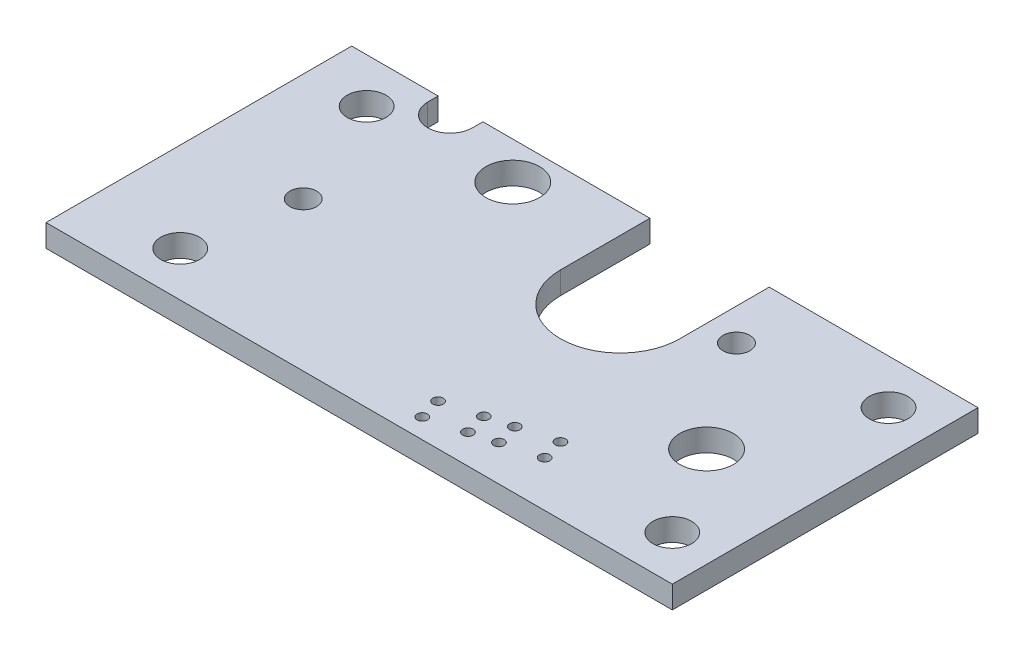
ISO-10303-21;
HEADER;
FILE_DESCRIPTION(('STEP AP214'),'2;1');
FILE_NAME('part.step','',(''),(''),'','','');
FILE_SCHEMA(('AUTOMOTIVE_DESIGN { 1 0 10303 214 1 1 1 1 }'));
ENDSEC;
DATA;
#1=APPLICATION_CONTEXT('core data for automotive mechanical design processes');
#2=APPLICATION_PROTOCOL_DEFINITION('international standard','automotive_design',2000,#1);
#3=PRODUCT_CONTEXT('',#1,'mechanical');
#4=PRODUCT('Part','Part','',(#3));
#5=PRODUCT_RELATED_PRODUCT_CATEGORY('part','',(#4));
#6=PRODUCT_DEFINITION_FORMATION('','',#4);
#7=PRODUCT_DEFINITION_CONTEXT('part definition',#1,'design');
#8=PRODUCT_DEFINITION('design','',#6,#7);
#9=PRODUCT_DEFINITION_SHAPE('','',#8);
#10=(LENGTH_UNIT() NAMED_UNIT(*) SI_UNIT(.MILLI.,.METRE.));
#11=(NAMED_UNIT(*) PLANE_ANGLE_UNIT() SI_UNIT($,.RADIAN.));
#12=(NAMED_UNIT(*) SI_UNIT($,.STERADIAN.) SOLID_ANGLE_UNIT());
#13=UNCERTAINTY_MEASURE_WITH_UNIT(LENGTH_MEASURE(1.E-05),#10,'distance_accuracy_value','');
#14=(GEOMETRIC_REPRESENTATION_CONTEXT(3) GLOBAL_UNCERTAINTY_ASSIGNED_CONTEXT((#13)) GLOBAL_UNIT_ASSIGNED_CONTEXT((#10,
#11,#12)) REPRESENTATION_CONTEXT('',''));
#15=CARTESIAN_POINT('',(0.,0.,0.));
#16=DIRECTION('',(0.,0.,1.));
#17=DIRECTION('',(1.,0.,0.));
#18=AXIS2_PLACEMENT_3D('',#15,#16,#17);
#19=CARTESIAN_POINT('',(0.,1.5,-20.5));
#20=DIRECTION('',(0.,0.,1.));
#21=DIRECTION('',(1.,0.,0.));
#22=AXIS2_PLACEMENT_3D('',#19,#20,#21);
#23=PLANE('',#22);
#24=DIRECTION('',(0.,1.,0.));
#25=VECTOR('',#24,1.);
#26=CARTESIAN_POINT('',(5.79999999999999,-0.000999999999999916,-20.5));
#27=LINE('',#26,#25);
#28=CARTESIAN_POINT('',(5.79999999999999,0.,-20.5));
#29=VERTEX_POINT('',#28);
#30=CARTESIAN_POINT('',(5.79999999999999,1.5,-20.5));
#31=VERTEX_POINT('',#30);
#32=EDGE_CURVE('E131',#29,#31,#27,.T.);
#33=ORIENTED_EDGE('',*,*,#32,.F.);
#34=DIRECTION('',(-1.,0.,0.));
#35=VECTOR('',#34,1.);
#36=CARTESIAN_POINT('',(0.,0.,-20.5));
#37=LINE('',#36,#35);
#38=CARTESIAN_POINT('',(0.,0.,-20.5));
#39=VERTEX_POINT('',#38);
#40=EDGE_CURVE('E148',#29,#39,#37,.T.);
#41=ORIENTED_EDGE('',*,*,#40,.T.);
#42=DIRECTION('',(0.,-1.,0.));
#43=VECTOR('',#42,1.);
#44=CARTESIAN_POINT('',(0.,1.5,-20.5));
#45=LINE('',#44,#43);
#46=CARTESIAN_POINT('',(0.,1.5,-20.5));
#47=VERTEX_POINT('',#46);
#48=EDGE_CURVE('E156',#47,#39,#45,.T.);
#49=ORIENTED_EDGE('',*,*,#48,.F.);
#50=DIRECTION('',(-1.,0.,0.));
#51=VECTOR('',#50,1.);
#52=CARTESIAN_POINT('',(0.,1.5,-20.5));
#53=LINE('',#52,#51);
#54=EDGE_CURVE('E182',#31,#47,#53,.T.);
#55=ORIENTED_EDGE('',*,*,#54,.F.);
#56=EDGE_LOOP('',(#33,#41,#49,#55));
#57=FACE_BOUND('',#56,.T.);
#58=ADVANCED_FACE('F31',(#57),#23,.F.);
#59=CARTESIAN_POINT('',(0.,1.5,-20.5));
#60=DIRECTION('',(0.,-1.,0.));
#61=DIRECTION('',(0.,0.,-1.));
#62=AXIS2_PLACEMENT_3D('',#59,#60,#61);
#63=PLANE('',#62);
#64=CARTESIAN_POINT('',(23.9062614807902,1.5,-1.3268753482699));
#65=DIRECTION('',(0.,1.,0.));
#66=DIRECTION('',(0.,0.,1.));
#67=AXIS2_PLACEMENT_3D('',#64,#65,#66);
#68=CIRCLE('',#67,0.350000000000001);
#69=CARTESIAN_POINT('',(23.9062614807902,1.5,-0.976875348269901));
#70=VERTEX_POINT('',#69);
#71=EDGE_CURVE('E310',#70,#70,#68,.T.);
#72=ORIENTED_EDGE('',*,*,#71,.F.);
#73=EDGE_LOOP('',(#72));
#74=FACE_BOUND('',#73,.T.);
#75=CARTESIAN_POINT('',(26.3210760465129,1.5,-1.97392296102617));
#76=DIRECTION('',(0.,1.,0.));
#77=DIRECTION('',(0.,0.,1.));
#78=AXIS2_PLACEMENT_3D('',#75,#76,#77);
#79=CIRCLE('',#78,0.350000000000001);
#80=CARTESIAN_POINT('',(26.3210760465129,1.5,-1.62392296102617));
#81=VERTEX_POINT('',#80);
#82=EDGE_CURVE('E304',#81,#81,#79,.T.);
#83=ORIENTED_EDGE('',*,*,#82,.F.);
#84=EDGE_LOOP('',(#83));
#85=FACE_BOUND('',#84,.T.);
#86=CARTESIAN_POINT('',(27.9631499512043,1.5,-2.41391533770044));
#87=DIRECTION('',(0.,1.,0.));
#88=DIRECTION('',(0.,0.,1.));
#89=AXIS2_PLACEMENT_3D('',#86,#87,#88);
#90=CIRCLE('',#89,0.350000000000001);
#91=CARTESIAN_POINT('',(27.9631499512043,1.5,-2.06391533770044));
#92=VERTEX_POINT('',#91);
#93=EDGE_CURVE('E298',#92,#92,#90,.T.);
#94=ORIENTED_EDGE('',*,*,#93,.F.);
#95=EDGE_LOOP('',(#94));
#96=FACE_BOUND('',#95,.T.);
#97=CARTESIAN_POINT('',(30.377964516927,1.5,-3.06096295045671));
#98=DIRECTION('',(0.,1.,0.));
#99=DIRECTION('',(0.,0.,1.));
#100=AXIS2_PLACEMENT_3D('',#97,#98,#99);
#101=CIRCLE('',#100,0.350000000000001);
#102=CARTESIAN_POINT('',(30.377964516927,1.5,-2.71096295045671));
#103=VERTEX_POINT('',#102);
#104=EDGE_CURVE('E292',#103,#103,#101,.T.);
#105=ORIENTED_EDGE('',*,*,#104,.F.);
#106=EDGE_LOOP('',(#105));
#107=FACE_BOUND('',#106,.T.);
#108=CARTESIAN_POINT('',(23.5180329131364,1.5,-2.77576408770351));
#109=DIRECTION('',(0.,1.,0.));
#110=DIRECTION('',(0.,0.,1.));
#111=AXIS2_PLACEMENT_3D('',#108,#109,#110);
#112=CIRCLE('',#111,0.350000000000001);
#113=CARTESIAN_POINT('',(23.5180329131364,1.5,-2.42576408770351));
#114=VERTEX_POINT('',#113);
#115=EDGE_CURVE('E286',#114,#114,#112,.T.);
#116=ORIENTED_EDGE('',*,*,#115,.F.);
#117=EDGE_LOOP('',(#116));
#118=FACE_BOUND('',#117,.T.);
#119=CARTESIAN_POINT('',(25.9328474788591,1.5,-3.42281170045978));
#120=DIRECTION('',(0.,1.,0.));
#121=DIRECTION('',(0.,0.,1.));
#122=AXIS2_PLACEMENT_3D('',#119,#120,#121);
#123=CIRCLE('',#122,0.350000000000001);
#124=CARTESIAN_POINT('',(25.9328474788591,1.5,-3.07281170045978));
#125=VERTEX_POINT('',#124);
#126=EDGE_CURVE('E280',#125,#125,#123,.T.);
#127=ORIENTED_EDGE('',*,*,#126,.F.);
#128=EDGE_LOOP('',(#127));
#129=FACE_BOUND('',#128,.T.);
#130=CARTESIAN_POINT('',(27.5749213835505,1.5,-3.86280407713404));
#131=DIRECTION('',(0.,1.,0.));
#132=DIRECTION('',(0.,0.,1.));
#133=AXIS2_PLACEMENT_3D('',#130,#131,#132);
#134=CIRCLE('',#133,0.350000000000001);
#135=CARTESIAN_POINT('',(27.5749213835505,1.5,-3.51280407713404));
#136=VERTEX_POINT('',#135);
#137=EDGE_CURVE('E274',#136,#136,#134,.T.);
#138=ORIENTED_EDGE('',*,*,#137,.F.);
#139=EDGE_LOOP('',(#138));
#140=FACE_BOUND('',#139,.T.);
#141=CARTESIAN_POINT('',(29.9897359492732,1.5,-4.50985168989031));
#142=DIRECTION('',(0.,1.,0.));
#143=DIRECTION('',(0.,0.,1.));
#144=AXIS2_PLACEMENT_3D('',#141,#142,#143);
#145=CIRCLE('',#144,0.350000000000001);
#146=CARTESIAN_POINT('',(29.9897359492732,1.5,-4.15985168989031));
#147=VERTEX_POINT('',#146);
#148=EDGE_CURVE('E268',#147,#147,#145,.T.);
#149=ORIENTED_EDGE('',*,*,#148,.F.);
#150=EDGE_LOOP('',(#149));
#151=FACE_BOUND('',#150,.T.);
#152=CARTESIAN_POINT('',(30.15,1.5,-16.15));
#153=DIRECTION('',(0.,1.,0.));
#154=DIRECTION('',(0.,0.,1.));
#155=AXIS2_PLACEMENT_3D('',#152,#153,#154);
#156=CIRCLE('',#155,0.900000000000001);
#157=CARTESIAN_POINT('',(30.15,1.5,-15.25));
#158=VERTEX_POINT('',#157);
#159=EDGE_CURVE('E259',#158,#158,#156,.T.);
#160=ORIENTED_EDGE('',*,*,#159,.F.);
#161=EDGE_LOOP('',(#160));
#162=FACE_BOUND('',#161,.T.);
#163=CARTESIAN_POINT('',(7.25,1.5,-10.));
#164=DIRECTION('',(0.,1.,0.));
#165=DIRECTION('',(0.,0.,1.));
#166=AXIS2_PLACEMENT_3D('',#163,#164,#165);
#167=CIRCLE('',#166,0.9);
#168=CARTESIAN_POINT('',(7.25,1.5,-9.1));
#169=VERTEX_POINT('',#168);
#170=EDGE_CURVE('E253',#169,#169,#167,.T.);
#171=ORIENTED_EDGE('',*,*,#170,.F.);
#172=EDGE_LOOP('',(#171));
#173=FACE_BOUND('',#172,.T.);
#174=CARTESIAN_POINT('',(39.,1.5,-17.5));
#175=DIRECTION('',(0.,1.,0.));
#176=DIRECTION('',(0.,0.,1.));
#177=AXIS2_PLACEMENT_3D('',#174,#175,#176);
#178=CIRCLE('',#177,1.3);
#179=CARTESIAN_POINT('',(39.,1.5,-16.2));
#180=VERTEX_POINT('',#179);
#181=EDGE_CURVE('E247',#180,#180,#178,.T.);
#182=ORIENTED_EDGE('',*,*,#181,.F.);
#183=EDGE_LOOP('',(#182));
#184=FACE_BOUND('',#183,.T.);
#185=CARTESIAN_POINT('',(39.,1.5,-3.));
#186=DIRECTION('',(0.,1.,0.));
#187=DIRECTION('',(0.,0.,1.));
#188=AXIS2_PLACEMENT_3D('',#185,#186,#187);
#189=CIRCLE('',#188,1.3);
#190=CARTESIAN_POINT('',(39.,1.5,-1.7));
#191=VERTEX_POINT('',#190);
#192=EDGE_CURVE('E241',#191,#191,#189,.T.);
#193=ORIENTED_EDGE('',*,*,#192,.F.);
#194=EDGE_LOOP('',(#193));
#195=FACE_BOUND('',#194,.T.);
#196=CARTESIAN_POINT('',(35.3,1.5,-9.));
#197=DIRECTION('',(0.,1.,0.));
#198=DIRECTION('',(0.,0.,1.));
#199=AXIS2_PLACEMENT_3D('',#196,#197,#198);
#200=CIRCLE('',#199,1.8);
#201=CARTESIAN_POINT('',(35.3,1.5,-7.2));
#202=VERTEX_POINT('',#201);
#203=EDGE_CURVE('E235',#202,#202,#200,.T.);
#204=ORIENTED_EDGE('',*,*,#203,.F.);
#205=EDGE_LOOP('',(#204));
#206=FACE_BOUND('',#205,.T.);
#207=CARTESIAN_POINT('',(13.3,1.5,-18.));
#208=DIRECTION('',(0.,1.,0.));
#209=DIRECTION('',(0.,0.,1.));
#210=AXIS2_PLACEMENT_3D('',#207,#208,#209);
#211=CIRCLE('',#210,1.8);
#212=CARTESIAN_POINT('',(13.3,1.5,-16.2));
#213=VERTEX_POINT('',#212);
#214=EDGE_CURVE('E142',#213,#213,#211,.T.);
#215=ORIENTED_EDGE('',*,*,#214,.F.);
#216=EDGE_LOOP('',(#215));
#217=FACE_BOUND('',#216,.T.);
#218=CARTESIAN_POINT('',(6.,1.5,-3.));
#219=DIRECTION('',(0.,1.,0.));
#220=DIRECTION('',(0.,0.,1.));
#221=AXIS2_PLACEMENT_3D('',#218,#219,#220);
#222=CIRCLE('',#221,1.3);
#223=CARTESIAN_POINT('',(6.,1.5,-1.7));
#224=VERTEX_POINT('',#223);
#225=EDGE_CURVE('E203',#224,#224,#222,.T.);
#226=ORIENTED_EDGE('',*,*,#225,.F.);
#227=EDGE_LOOP('',(#226));
#228=FACE_BOUND('',#227,.T.);
#229=CARTESIAN_POINT('',(4.,1.5,-17.5));
#230=DIRECTION('',(0.,1.,0.));
#231=DIRECTION('',(0.,0.,1.));
#232=AXIS2_PLACEMENT_3D('',#229,#230,#231);
#233=CIRCLE('',#232,1.3);
#234=CARTESIAN_POINT('',(4.,1.5,-16.2));
#235=VERTEX_POINT('',#234);
#236=EDGE_CURVE('E212',#235,#235,#233,.T.);
#237=ORIENTED_EDGE('',*,*,#236,.F.);
#238=EDGE_LOOP('',(#237));
#239=FACE_BOUND('',#238,.T.);
#240=DIRECTION('',(0.,0.,-1.));
#241=VECTOR('',#240,1.);
#242=CARTESIAN_POINT('',(5.79999999999995,1.5,-10.2499999999999));
#243=LINE('',#242,#241);
#244=CARTESIAN_POINT('',(5.79999999999998,1.5,-19.8));
#245=VERTEX_POINT('',#244);
#246=EDGE_CURVE('E228',#245,#31,#243,.T.);
#247=ORIENTED_EDGE('',*,*,#246,.T.);
#248=ORIENTED_EDGE('',*,*,#54,.T.);
#249=DIRECTION('',(0.,0.,1.));
#250=VECTOR('',#249,1.);
#251=CARTESIAN_POINT('',(0.,1.5,0.));
#252=LINE('',#251,#250);
#253=CARTESIAN_POINT('',(0.,1.5,0.));
#254=VERTEX_POINT('',#253);
#255=EDGE_CURVE('E151',#47,#254,#252,.T.);
#256=ORIENTED_EDGE('',*,*,#255,.T.);
#257=DIRECTION('',(1.,0.,0.));
#258=VECTOR('',#257,1.);
#259=CARTESIAN_POINT('',(0.,1.5,0.));
#260=LINE('',#259,#258);
#261=CARTESIAN_POINT('',(42.,1.5,0.));
#262=VERTEX_POINT('',#261);
#263=EDGE_CURVE('E184',#254,#262,#260,.T.);
#264=ORIENTED_EDGE('',*,*,#263,.T.);
#265=DIRECTION('',(0.,0.,-1.));
#266=VECTOR('',#265,1.);
#267=CARTESIAN_POINT('',(42.,1.5,0.));
#268=LINE('',#267,#266);
#269=CARTESIAN_POINT('',(42.,1.5,-20.5));
#270=VERTEX_POINT('',#269);
#271=EDGE_CURVE('E169',#262,#270,#268,.T.);
#272=ORIENTED_EDGE('',*,*,#271,.T.);
#273=CARTESIAN_POINT('',(28.,1.5,-20.5));
#274=VERTEX_POINT('',#273);
#275=EDGE_CURVE('E160',#270,#274,#53,.T.);
#276=ORIENTED_EDGE('',*,*,#275,.T.);
#277=DIRECTION('',(0.,0.,-1.));
#278=VECTOR('',#277,1.);
#279=CARTESIAN_POINT('',(28.,1.5,-10.25));
#280=LINE('',#279,#278);
#281=CARTESIAN_POINT('',(28.,1.5,-14.5));
#282=VERTEX_POINT('',#281);
#283=EDGE_CURVE('E198',#282,#274,#280,.T.);
#284=ORIENTED_EDGE('',*,*,#283,.F.);
#285=CARTESIAN_POINT('',(24.,1.5,-14.5));
#286=DIRECTION('',(0.,1.,0.));
#287=DIRECTION('',(0.,0.,1.));
#288=AXIS2_PLACEMENT_3D('',#285,#286,#287);
#289=CIRCLE('',#288,4.);
#290=CARTESIAN_POINT('',(20.,1.5,-14.5));
#291=VERTEX_POINT('',#290);
#292=EDGE_CURVE('E200',#291,#282,#289,.T.);
#293=ORIENTED_EDGE('',*,*,#292,.F.);
#294=DIRECTION('',(0.,0.,-1.));
#295=VECTOR('',#294,1.);
#296=CARTESIAN_POINT('',(20.,1.5,-10.25));
#297=LINE('',#296,#295);
#298=CARTESIAN_POINT('',(20.,1.5,-20.5));
#299=VERTEX_POINT('',#298);
#300=EDGE_CURVE('E194',#291,#299,#297,.T.);
#301=ORIENTED_EDGE('',*,*,#300,.T.);
#302=CARTESIAN_POINT('',(8.79999999999998,1.5,-20.5));
#303=VERTEX_POINT('',#302);
#304=EDGE_CURVE('E181',#299,#303,#53,.T.);
#305=ORIENTED_EDGE('',*,*,#304,.T.);
#306=DIRECTION('',(0.,0.,-1.));
#307=VECTOR('',#306,1.);
#308=CARTESIAN_POINT('',(8.80000000000003,1.5,-10.2500000000001));
#309=LINE('',#308,#307);
#310=CARTESIAN_POINT('',(8.79999999999998,1.5,-19.8));
#311=VERTEX_POINT('',#310);
#312=EDGE_CURVE('E126',#311,#303,#309,.T.);
#313=ORIENTED_EDGE('',*,*,#312,.F.);
#314=CARTESIAN_POINT('',(7.29999999999998,1.5,-19.8));
#315=DIRECTION('',(0.,1.,0.));
#316=DIRECTION('',(0.,0.,1.));
#317=AXIS2_PLACEMENT_3D('',#314,#315,#316);
#318=CIRCLE('',#317,1.5);
#319=EDGE_CURVE('E226',#245,#311,#318,.T.);
#320=ORIENTED_EDGE('',*,*,#319,.F.);
#321=EDGE_LOOP('',(#247,#248,#256,#264,#272,#276,#284,#293,#301,#305,#313,#320));
#322=FACE_BOUND('',#321,.T.);
#323=ADVANCED_FACE('F325',(#74,#85,#96,#107,#118,#129,#140,#151,#162,#173,#184,#195,#206,#217,
#228,#239,#322),#63,.F.);
#324=CARTESIAN_POINT('',(0.,0.,-20.5));
#325=DIRECTION('',(0.,-1.,0.));
#326=DIRECTION('',(0.,0.,-1.));
#327=AXIS2_PLACEMENT_3D('',#324,#325,#326);
#328=PLANE('',#327);
#329=CARTESIAN_POINT('',(23.9062614807902,0.,-1.3268753482699));
#330=DIRECTION('',(0.,1.,0.));
#331=DIRECTION('',(0.,0.,1.));
#332=AXIS2_PLACEMENT_3D('',#329,#330,#331);
#333=CIRCLE('',#332,0.350000000000001);
#334=CARTESIAN_POINT('',(23.9062614807902,0.,-0.976875348269901));
#335=VERTEX_POINT('',#334);
#336=EDGE_CURVE('E307',#335,#335,#333,.T.);
#337=ORIENTED_EDGE('',*,*,#336,.T.);
#338=EDGE_LOOP('',(#337));
#339=FACE_BOUND('',#338,.T.);
#340=CARTESIAN_POINT('',(26.3210760465129,0.,-1.97392296102617));
#341=DIRECTION('',(0.,1.,0.));
#342=DIRECTION('',(0.,0.,1.));
#343=AXIS2_PLACEMENT_3D('',#340,#341,#342);
#344=CIRCLE('',#343,0.350000000000001);
#345=CARTESIAN_POINT('',(26.3210760465129,0.,-1.62392296102617));
#346=VERTEX_POINT('',#345);
#347=EDGE_CURVE('E301',#346,#346,#344,.T.);
#348=ORIENTED_EDGE('',*,*,#347,.T.);
#349=EDGE_LOOP('',(#348));
#350=FACE_BOUND('',#349,.T.);
#351=CARTESIAN_POINT('',(27.9631499512043,0.,-2.41391533770044));
#352=DIRECTION('',(0.,1.,0.));
#353=DIRECTION('',(0.,0.,1.));
#354=AXIS2_PLACEMENT_3D('',#351,#352,#353);
#355=CIRCLE('',#354,0.350000000000001);
#356=CARTESIAN_POINT('',(27.9631499512043,0.,-2.06391533770044));
#357=VERTEX_POINT('',#356);
#358=EDGE_CURVE('E295',#357,#357,#355,.T.);
#359=ORIENTED_EDGE('',*,*,#358,.T.);
#360=EDGE_LOOP('',(#359));
#361=FACE_BOUND('',#360,.T.);
#362=CARTESIAN_POINT('',(30.377964516927,0.,-3.06096295045671));
#363=DIRECTION('',(0.,1.,0.));
#364=DIRECTION('',(0.,0.,1.));
#365=AXIS2_PLACEMENT_3D('',#362,#363,#364);
#366=CIRCLE('',#365,0.350000000000001);
#367=CARTESIAN_POINT('',(30.377964516927,0.,-2.71096295045671));
#368=VERTEX_POINT('',#367);
#369=EDGE_CURVE('E289',#368,#368,#366,.T.);
#370=ORIENTED_EDGE('',*,*,#369,.T.);
#371=EDGE_LOOP('',(#370));
#372=FACE_BOUND('',#371,.T.);
#373=CARTESIAN_POINT('',(23.5180329131364,0.,-2.77576408770351));
#374=DIRECTION('',(0.,1.,0.));
#375=DIRECTION('',(0.,0.,1.));
#376=AXIS2_PLACEMENT_3D('',#373,#374,#375);
#377=CIRCLE('',#376,0.350000000000001);
#378=CARTESIAN_POINT('',(23.5180329131364,0.,-2.42576408770351));
#379=VERTEX_POINT('',#378);
#380=EDGE_CURVE('E283',#379,#379,#377,.T.);
#381=ORIENTED_EDGE('',*,*,#380,.T.);
#382=EDGE_LOOP('',(#381));
#383=FACE_BOUND('',#382,.T.);
#384=CARTESIAN_POINT('',(25.9328474788591,0.,-3.42281170045978));
#385=DIRECTION('',(0.,1.,0.));
#386=DIRECTION('',(0.,0.,1.));
#387=AXIS2_PLACEMENT_3D('',#384,#385,#386);
#388=CIRCLE('',#387,0.350000000000001);
#389=CARTESIAN_POINT('',(25.9328474788591,0.,-3.07281170045978));
#390=VERTEX_POINT('',#389);
#391=EDGE_CURVE('E277',#390,#390,#388,.T.);
#392=ORIENTED_EDGE('',*,*,#391,.T.);
#393=EDGE_LOOP('',(#392));
#394=FACE_BOUND('',#393,.T.);
#395=CARTESIAN_POINT('',(27.5749213835505,0.,-3.86280407713404));
#396=DIRECTION('',(0.,1.,0.));
#397=DIRECTION('',(0.,0.,1.));
#398=AXIS2_PLACEMENT_3D('',#395,#396,#397);
#399=CIRCLE('',#398,0.350000000000001);
#400=CARTESIAN_POINT('',(27.5749213835505,0.,-3.51280407713404));
#401=VERTEX_POINT('',#400);
#402=EDGE_CURVE('E271',#401,#401,#399,.T.);
#403=ORIENTED_EDGE('',*,*,#402,.T.);
#404=EDGE_LOOP('',(#403));
#405=FACE_BOUND('',#404,.T.);
#406=CARTESIAN_POINT('',(29.9897359492732,0.,-4.50985168989031));
#407=DIRECTION('',(0.,1.,0.));
#408=DIRECTION('',(0.,0.,1.));
#409=AXIS2_PLACEMENT_3D('',#406,#407,#408);
#410=CIRCLE('',#409,0.350000000000001);
#411=CARTESIAN_POINT('',(29.9897359492732,0.,-4.15985168989031));
#412=VERTEX_POINT('',#411);
#413=EDGE_CURVE('E265',#412,#412,#410,.T.);
#414=ORIENTED_EDGE('',*,*,#413,.T.);
#415=EDGE_LOOP('',(#414));
#416=FACE_BOUND('',#415,.T.);
#417=CARTESIAN_POINT('',(30.15,0.,-16.15));
#418=DIRECTION('',(0.,-1.,0.));
#419=DIRECTION('',(0.,0.,-1.));
#420=AXIS2_PLACEMENT_3D('',#417,#418,#419);
#421=CIRCLE('',#420,0.900000000000001);
#422=CARTESIAN_POINT('',(30.15,0.,-17.05));
#423=VERTEX_POINT('',#422);
#424=EDGE_CURVE('E262',#423,#423,#421,.F.);
#425=ORIENTED_EDGE('',*,*,#424,.T.);
#426=EDGE_LOOP('',(#425));
#427=FACE_BOUND('',#426,.T.);
#428=CARTESIAN_POINT('',(7.25,0.,-10.));
#429=DIRECTION('',(0.,-1.,0.));
#430=DIRECTION('',(0.,0.,-1.));
#431=AXIS2_PLACEMENT_3D('',#428,#429,#430);
#432=CIRCLE('',#431,0.9);
#433=CARTESIAN_POINT('',(7.25,0.,-10.9));
#434=VERTEX_POINT('',#433);
#435=EDGE_CURVE('E256',#434,#434,#432,.F.);
#436=ORIENTED_EDGE('',*,*,#435,.T.);
#437=EDGE_LOOP('',(#436));
#438=FACE_BOUND('',#437,.T.);
#439=CARTESIAN_POINT('',(39.,0.,-17.5));
#440=DIRECTION('',(0.,-1.,0.));
#441=DIRECTION('',(0.,0.,-1.));
#442=AXIS2_PLACEMENT_3D('',#439,#440,#441);
#443=CIRCLE('',#442,1.3);
#444=CARTESIAN_POINT('',(39.,0.,-18.8));
#445=VERTEX_POINT('',#444);
#446=EDGE_CURVE('E250',#445,#445,#443,.F.);
#447=ORIENTED_EDGE('',*,*,#446,.T.);
#448=EDGE_LOOP('',(#447));
#449=FACE_BOUND('',#448,.T.);
#450=CARTESIAN_POINT('',(39.,0.,-3.));
#451=DIRECTION('',(0.,-1.,0.));
#452=DIRECTION('',(0.,0.,-1.));
#453=AXIS2_PLACEMENT_3D('',#450,#451,#452);
#454=CIRCLE('',#453,1.3);
#455=CARTESIAN_POINT('',(39.,0.,-4.3));
#456=VERTEX_POINT('',#455);
#457=EDGE_CURVE('E244',#456,#456,#454,.F.);
#458=ORIENTED_EDGE('',*,*,#457,.T.);
#459=EDGE_LOOP('',(#458));
#460=FACE_BOUND('',#459,.T.);
#461=CARTESIAN_POINT('',(35.3,0.,-9.));
#462=DIRECTION('',(0.,-1.,0.));
#463=DIRECTION('',(0.,0.,-1.));
#464=AXIS2_PLACEMENT_3D('',#461,#462,#463);
#465=CIRCLE('',#464,1.8);
#466=CARTESIAN_POINT('',(35.3,0.,-10.8));
#467=VERTEX_POINT('',#466);
#468=EDGE_CURVE('E238',#467,#467,#465,.F.);
#469=ORIENTED_EDGE('',*,*,#468,.T.);
#470=EDGE_LOOP('',(#469));
#471=FACE_BOUND('',#470,.T.);
#472=CARTESIAN_POINT('',(13.3,0.,-18.));
#473=DIRECTION('',(0.,-1.,0.));
#474=DIRECTION('',(0.,0.,-1.));
#475=AXIS2_PLACEMENT_3D('',#472,#473,#474);
#476=CIRCLE('',#475,1.8);
#477=CARTESIAN_POINT('',(13.3,0.,-19.8));
#478=VERTEX_POINT('',#477);
#479=EDGE_CURVE('E232',#478,#478,#476,.F.);
#480=ORIENTED_EDGE('',*,*,#479,.T.);
#481=EDGE_LOOP('',(#480));
#482=FACE_BOUND('',#481,.T.);
#483=CARTESIAN_POINT('',(6.,0.,-3.));
#484=DIRECTION('',(0.,-1.,0.));
#485=DIRECTION('',(0.,0.,-1.));
#486=AXIS2_PLACEMENT_3D('',#483,#484,#485);
#487=CIRCLE('',#486,1.3);
#488=CARTESIAN_POINT('',(6.,0.,-4.3));
#489=VERTEX_POINT('',#488);
#490=EDGE_CURVE('E209',#489,#489,#487,.F.);
#491=ORIENTED_EDGE('',*,*,#490,.T.);
#492=EDGE_LOOP('',(#491));
#493=FACE_BOUND('',#492,.T.);
#494=CARTESIAN_POINT('',(4.,0.,-17.5));
#495=DIRECTION('',(0.,-1.,0.));
#496=DIRECTION('',(0.,0.,-1.));
#497=AXIS2_PLACEMENT_3D('',#494,#495,#496);
#498=CIRCLE('',#497,1.3);
#499=CARTESIAN_POINT('',(4.,0.,-18.8));
#500=VERTEX_POINT('',#499);
#501=EDGE_CURVE('E215',#500,#500,#498,.F.);
#502=ORIENTED_EDGE('',*,*,#501,.T.);
#503=EDGE_LOOP('',(#502));
#504=FACE_BOUND('',#503,.T.);
#505=ORIENTED_EDGE('',*,*,#40,.F.);
#506=DIRECTION('',(0.,0.,-1.));
#507=VECTOR('',#506,1.);
#508=CARTESIAN_POINT('',(5.79999999999995,0.,-10.2499999999999));
#509=LINE('',#508,#507);
#510=CARTESIAN_POINT('',(5.79999999999998,0.,-19.8));
#511=VERTEX_POINT('',#510);
#512=EDGE_CURVE('E141',#511,#29,#509,.T.);
#513=ORIENTED_EDGE('',*,*,#512,.F.);
#514=CARTESIAN_POINT('',(7.29999999999998,0.,-19.8));
#515=DIRECTION('',(0.,-1.,0.));
#516=DIRECTION('',(0.,0.,-1.));
#517=AXIS2_PLACEMENT_3D('',#514,#515,#516);
#518=CIRCLE('',#517,1.5);
#519=CARTESIAN_POINT('',(8.79999999999998,0.,-19.8));
#520=VERTEX_POINT('',#519);
#521=EDGE_CURVE('E140',#511,#520,#518,.F.);
#522=ORIENTED_EDGE('',*,*,#521,.T.);
#523=DIRECTION('',(0.,0.,-1.));
#524=VECTOR('',#523,1.);
#525=CARTESIAN_POINT('',(8.80000000000003,0.,-10.2500000000001));
#526=LINE('',#525,#524);
#527=CARTESIAN_POINT('',(8.79999999999998,0.,-20.5));
#528=VERTEX_POINT('',#527);
#529=EDGE_CURVE('E123',#520,#528,#526,.T.);
#530=ORIENTED_EDGE('',*,*,#529,.T.);
#531=CARTESIAN_POINT('',(20.,0.,-20.5));
#532=VERTEX_POINT('',#531);
#533=EDGE_CURVE('E138',#532,#528,#37,.T.);
#534=ORIENTED_EDGE('',*,*,#533,.F.);
#535=DIRECTION('',(0.,0.,-1.));
#536=VECTOR('',#535,1.);
#537=CARTESIAN_POINT('',(20.,0.,-10.25));
#538=LINE('',#537,#536);
#539=CARTESIAN_POINT('',(20.,0.,-14.5));
#540=VERTEX_POINT('',#539);
#541=EDGE_CURVE('E190',#540,#532,#538,.T.);
#542=ORIENTED_EDGE('',*,*,#541,.F.);
#543=CARTESIAN_POINT('',(24.,0.,-14.5));
#544=DIRECTION('',(0.,1.,0.));
#545=DIRECTION('',(0.,0.,1.));
#546=AXIS2_PLACEMENT_3D('',#543,#544,#545);
#547=CIRCLE('',#546,4.);
#548=CARTESIAN_POINT('',(28.,0.,-14.5));
#549=VERTEX_POINT('',#548);
#550=EDGE_CURVE('E197',#540,#549,#547,.T.);
#551=ORIENTED_EDGE('',*,*,#550,.T.);
#552=DIRECTION('',(0.,0.,-1.));
#553=VECTOR('',#552,1.);
#554=CARTESIAN_POINT('',(28.,0.,-10.25));
#555=LINE('',#554,#553);
#556=CARTESIAN_POINT('',(28.,0.,-20.5));
#557=VERTEX_POINT('',#556);
#558=EDGE_CURVE('E205',#549,#557,#555,.T.);
#559=ORIENTED_EDGE('',*,*,#558,.T.);
#560=CARTESIAN_POINT('',(42.,0.,-20.5));
#561=VERTEX_POINT('',#560);
#562=EDGE_CURVE('E147',#561,#557,#37,.T.);
#563=ORIENTED_EDGE('',*,*,#562,.F.);
#564=DIRECTION('',(0.,0.,-1.));
#565=VECTOR('',#564,1.);
#566=CARTESIAN_POINT('',(42.,0.,0.));
#567=LINE('',#566,#565);
#568=CARTESIAN_POINT('',(42.,0.,0.));
#569=VERTEX_POINT('',#568);
#570=EDGE_CURVE('E152',#569,#561,#567,.T.);
#571=ORIENTED_EDGE('',*,*,#570,.F.);
#572=DIRECTION('',(1.,0.,0.));
#573=VECTOR('',#572,1.);
#574=CARTESIAN_POINT('',(0.,0.,0.));
#575=LINE('',#574,#573);
#576=CARTESIAN_POINT('',(0.,0.,0.));
#577=VERTEX_POINT('',#576);
#578=EDGE_CURVE('E173',#577,#569,#575,.T.);
#579=ORIENTED_EDGE('',*,*,#578,.F.);
#580=DIRECTION('',(0.,0.,1.));
#581=VECTOR('',#580,1.);
#582=CARTESIAN_POINT('',(0.,0.,0.));
#583=LINE('',#582,#581);
#584=EDGE_CURVE('E174',#39,#577,#583,.T.);
#585=ORIENTED_EDGE('',*,*,#584,.F.);
#586=EDGE_LOOP('',(#505,#513,#522,#530,#534,#542,#551,#559,#563,#571,#579,#585));
#587=FACE_BOUND('',#586,.T.);
#588=ADVANCED_FACE('F136',(#339,#350,#361,#372,#383,#394,#405,#416,#427,#438,#449,#460,#471,
#482,#493,#504,#587),#328,.T.);
#589=ORIENTED_EDGE('',*,*,#533,.T.);
#590=DIRECTION('',(0.,1.,0.));
#591=VECTOR('',#590,1.);
#592=CARTESIAN_POINT('',(8.79999999999998,-0.000999999999999916,-20.5));
#593=LINE('',#592,#591);
#594=EDGE_CURVE('E120',#528,#303,#593,.T.);
#595=ORIENTED_EDGE('',*,*,#594,.T.);
#596=ORIENTED_EDGE('',*,*,#304,.F.);
#597=DIRECTION('',(0.,1.,0.));
#598=VECTOR('',#597,1.);
#599=CARTESIAN_POINT('',(20.,0.,-20.5));
#600=LINE('',#599,#598);
#601=EDGE_CURVE('E146',#532,#299,#600,.T.);
#602=ORIENTED_EDGE('',*,*,#601,.F.);
#603=EDGE_LOOP('',(#589,#595,#596,#602));
#604=FACE_BOUND('',#603,.T.);
#605=ADVANCED_FACE('F145',(#604),#23,.F.);
#606=CARTESIAN_POINT('',(0.,1.5,0.));
#607=DIRECTION('',(1.,0.,0.));
#608=DIRECTION('',(0.,0.,-1.));
#609=AXIS2_PLACEMENT_3D('',#606,#607,#608);
#610=PLANE('',#609);
#611=ORIENTED_EDGE('',*,*,#584,.T.);
#612=DIRECTION('',(0.,-1.,0.));
#613=VECTOR('',#612,1.);
#614=CARTESIAN_POINT('',(0.,1.5,0.));
#615=LINE('',#614,#613);
#616=EDGE_CURVE('E11',#254,#577,#615,.T.);
#617=ORIENTED_EDGE('',*,*,#616,.F.);
#618=ORIENTED_EDGE('',*,*,#255,.F.);
#619=ORIENTED_EDGE('',*,*,#48,.T.);
#620=EDGE_LOOP('',(#611,#617,#618,#619));
#621=FACE_BOUND('',#620,.T.);
#622=ADVANCED_FACE('F33',(#621),#610,.F.);
#623=CARTESIAN_POINT('',(0.,1.5,0.));
#624=DIRECTION('',(0.,0.,-1.));
#625=DIRECTION('',(-1.,0.,0.));
#626=AXIS2_PLACEMENT_3D('',#623,#624,#625);
#627=PLANE('',#626);
#628=ORIENTED_EDGE('',*,*,#578,.T.);
#629=DIRECTION('',(0.,-1.,0.));
#630=VECTOR('',#629,1.);
#631=CARTESIAN_POINT('',(42.,1.5,0.));
#632=LINE('',#631,#630);
#633=EDGE_CURVE('E39',#262,#569,#632,.T.);
#634=ORIENTED_EDGE('',*,*,#633,.F.);
#635=ORIENTED_EDGE('',*,*,#263,.F.);
#636=ORIENTED_EDGE('',*,*,#616,.T.);
#637=EDGE_LOOP('',(#628,#634,#635,#636));
#638=FACE_BOUND('',#637,.T.);
#639=ADVANCED_FACE('F403',(#638),#627,.F.);
#640=CARTESIAN_POINT('',(42.,1.5,0.));
#641=DIRECTION('',(-1.,0.,0.));
#642=DIRECTION('',(0.,0.,1.));
#643=AXIS2_PLACEMENT_3D('',#640,#641,#642);
#644=PLANE('',#643);
#645=ORIENTED_EDGE('',*,*,#570,.T.);
#646=DIRECTION('',(0.,-1.,0.));
#647=VECTOR('',#646,1.);
#648=CARTESIAN_POINT('',(42.,1.5,-20.5));
#649=LINE('',#648,#647);
#650=EDGE_CURVE('E159',#270,#561,#649,.T.);
#651=ORIENTED_EDGE('',*,*,#650,.F.);
#652=ORIENTED_EDGE('',*,*,#271,.F.);
#653=ORIENTED_EDGE('',*,*,#633,.T.);
#654=EDGE_LOOP('',(#645,#651,#652,#653));
#655=FACE_BOUND('',#654,.T.);
#656=ADVANCED_FACE('F167',(#655),#644,.F.);
#657=ORIENTED_EDGE('',*,*,#562,.T.);
#658=DIRECTION('',(0.,1.,0.));
#659=VECTOR('',#658,1.);
#660=CARTESIAN_POINT('',(28.,0.,-20.5));
#661=LINE('',#660,#659);
#662=EDGE_CURVE('E54',#557,#274,#661,.T.);
#663=ORIENTED_EDGE('',*,*,#662,.T.);
#664=ORIENTED_EDGE('',*,*,#275,.F.);
#665=ORIENTED_EDGE('',*,*,#650,.T.);
#666=EDGE_LOOP('',(#657,#663,#664,#665));
#667=FACE_BOUND('',#666,.T.);
#668=ADVANCED_FACE('F391',(#667),#23,.F.);
#669=CARTESIAN_POINT('',(24.,0.,-14.5));
#670=DIRECTION('',(0.,1.,0.));
#671=DIRECTION('',(0.,0.,1.));
#672=AXIS2_PLACEMENT_3D('',#669,#670,#671);
#673=CYLINDRICAL_SURFACE('',#672,4.);
#674=ORIENTED_EDGE('',*,*,#292,.T.);
#675=DIRECTION('',(0.,1.,0.));
#676=VECTOR('',#675,1.);
#677=CARTESIAN_POINT('',(28.,0.,-14.5));
#678=LINE('',#677,#676);
#679=EDGE_CURVE('E188',#549,#282,#678,.T.);
#680=ORIENTED_EDGE('',*,*,#679,.F.);
#681=ORIENTED_EDGE('',*,*,#550,.F.);
#682=DIRECTION('',(0.,1.,0.));
#683=VECTOR('',#682,1.);
#684=CARTESIAN_POINT('',(20.,0.,-14.5));
#685=LINE('',#684,#683);
#686=EDGE_CURVE('E176',#540,#291,#685,.T.);
#687=ORIENTED_EDGE('',*,*,#686,.T.);
#688=EDGE_LOOP('',(#674,#680,#681,#687));
#689=FACE_BOUND('',#688,.T.);
#690=ADVANCED_FACE('F375',(#689),#673,.F.);
#691=CARTESIAN_POINT('',(20.,0.,-10.25));
#692=DIRECTION('',(1.,0.,0.));
#693=DIRECTION('',(0.,0.,-1.));
#694=AXIS2_PLACEMENT_3D('',#691,#692,#693);
#695=PLANE('',#694);
#696=ORIENTED_EDGE('',*,*,#300,.F.);
#697=ORIENTED_EDGE('',*,*,#686,.F.);
#698=ORIENTED_EDGE('',*,*,#541,.T.);
#699=ORIENTED_EDGE('',*,*,#601,.T.);
#700=EDGE_LOOP('',(#696,#697,#698,#699));
#701=FACE_BOUND('',#700,.T.);
#702=ADVANCED_FACE('F372',(#701),#695,.T.);
#703=CARTESIAN_POINT('',(28.,0.,-10.25));
#704=DIRECTION('',(1.,0.,0.));
#705=DIRECTION('',(0.,0.,-1.));
#706=AXIS2_PLACEMENT_3D('',#703,#704,#705);
#707=PLANE('',#706);
#708=ORIENTED_EDGE('',*,*,#283,.T.);
#709=ORIENTED_EDGE('',*,*,#662,.F.);
#710=ORIENTED_EDGE('',*,*,#558,.F.);
#711=ORIENTED_EDGE('',*,*,#679,.T.);
#712=EDGE_LOOP('',(#708,#709,#710,#711));
#713=FACE_BOUND('',#712,.T.);
#714=ADVANCED_FACE('F376',(#713),#707,.F.);
#715=CARTESIAN_POINT('',(6.,-0.000999999999999916,-3.));
#716=DIRECTION('',(0.,1.,0.));
#717=DIRECTION('',(0.,0.,1.));
#718=AXIS2_PLACEMENT_3D('',#715,#716,#717);
#719=CYLINDRICAL_SURFACE('',#718,1.3);
#720=ORIENTED_EDGE('',*,*,#490,.F.);
#721=EDGE_LOOP('',(#720));
#722=FACE_BOUND('',#721,.T.);
#723=ORIENTED_EDGE('',*,*,#225,.T.);
#724=EDGE_LOOP('',(#723));
#725=FACE_BOUND('',#724,.T.);
#726=ADVANCED_FACE('F378',(#722,#725),#719,.F.);
#727=CARTESIAN_POINT('',(4.,-0.000999999999999916,-17.5));
#728=DIRECTION('',(0.,1.,0.));
#729=DIRECTION('',(0.,0.,1.));
#730=AXIS2_PLACEMENT_3D('',#727,#728,#729);
#731=CYLINDRICAL_SURFACE('',#730,1.3);
#732=ORIENTED_EDGE('',*,*,#501,.F.);
#733=EDGE_LOOP('',(#732));
#734=FACE_BOUND('',#733,.T.);
#735=ORIENTED_EDGE('',*,*,#236,.T.);
#736=EDGE_LOOP('',(#735));
#737=FACE_BOUND('',#736,.T.);
#738=ADVANCED_FACE('F384',(#734,#737),#731,.F.);
#739=CARTESIAN_POINT('',(5.79999999999995,-0.000999999999999916,-10.2499999999999));
#740=DIRECTION('',(1.,0.,0.));
#741=DIRECTION('',(0.,0.,-1.));
#742=AXIS2_PLACEMENT_3D('',#739,#740,#741);
#743=PLANE('',#742);
#744=ORIENTED_EDGE('',*,*,#512,.T.);
#745=ORIENTED_EDGE('',*,*,#32,.T.);
#746=ORIENTED_EDGE('',*,*,#246,.F.);
#747=DIRECTION('',(0.,1.,0.));
#748=VECTOR('',#747,1.);
#749=CARTESIAN_POINT('',(5.79999999999998,-0.000999999999999916,-19.8));
#750=LINE('',#749,#748);
#751=EDGE_CURVE('E221',#511,#245,#750,.T.);
#752=ORIENTED_EDGE('',*,*,#751,.F.);
#753=EDGE_LOOP('',(#744,#745,#746,#752));
#754=FACE_BOUND('',#753,.T.);
#755=ADVANCED_FACE('F407',(#754),#743,.T.);
#756=CARTESIAN_POINT('',(8.80000000000003,-0.000999999999999916,-10.2500000000001));
#757=DIRECTION('',(1.,0.,0.));
#758=DIRECTION('',(0.,0.,-1.));
#759=AXIS2_PLACEMENT_3D('',#756,#757,#758);
#760=PLANE('',#759);
#761=DIRECTION('',(0.,1.,0.));
#762=VECTOR('',#761,1.);
#763=CARTESIAN_POINT('',(8.79999999999998,-0.000999999999999916,-19.8));
#764=LINE('',#763,#762);
#765=EDGE_CURVE('E46',#520,#311,#764,.T.);
#766=ORIENTED_EDGE('',*,*,#765,.T.);
#767=ORIENTED_EDGE('',*,*,#312,.T.);
#768=ORIENTED_EDGE('',*,*,#594,.F.);
#769=ORIENTED_EDGE('',*,*,#529,.F.);
#770=EDGE_LOOP('',(#766,#767,#768,#769));
#771=FACE_BOUND('',#770,.T.);
#772=ADVANCED_FACE('F122',(#771),#760,.F.);
#773=CARTESIAN_POINT('',(7.29999999999998,-0.000999999999999916,-19.8));
#774=DIRECTION('',(0.,1.,0.));
#775=DIRECTION('',(0.,0.,1.));
#776=AXIS2_PLACEMENT_3D('',#773,#774,#775);
#777=CYLINDRICAL_SURFACE('',#776,1.5);
#778=ORIENTED_EDGE('',*,*,#751,.T.);
#779=ORIENTED_EDGE('',*,*,#319,.T.);
#780=ORIENTED_EDGE('',*,*,#765,.F.);
#781=ORIENTED_EDGE('',*,*,#521,.F.);
#782=EDGE_LOOP('',(#778,#779,#780,#781));
#783=FACE_BOUND('',#782,.T.);
#784=ADVANCED_FACE('F408',(#783),#777,.F.);
#785=CARTESIAN_POINT('',(13.3,-0.000999999999999916,-18.));
#786=DIRECTION('',(0.,1.,0.));
#787=DIRECTION('',(0.,0.,1.));
#788=AXIS2_PLACEMENT_3D('',#785,#786,#787);
#789=CYLINDRICAL_SURFACE('',#788,1.8);
#790=ORIENTED_EDGE('',*,*,#479,.F.);
#791=EDGE_LOOP('',(#790));
#792=FACE_BOUND('',#791,.T.);
#793=ORIENTED_EDGE('',*,*,#214,.T.);
#794=EDGE_LOOP('',(#793));
#795=FACE_BOUND('',#794,.T.);
#796=ADVANCED_FACE('F410',(#792,#795),#789,.F.);
#797=CARTESIAN_POINT('',(35.3,-0.000999999999999916,-9.));
#798=DIRECTION('',(0.,1.,0.));
#799=DIRECTION('',(0.,0.,1.));
#800=AXIS2_PLACEMENT_3D('',#797,#798,#799);
#801=CYLINDRICAL_SURFACE('',#800,1.8);
#802=ORIENTED_EDGE('',*,*,#468,.F.);
#803=EDGE_LOOP('',(#802));
#804=FACE_BOUND('',#803,.T.);
#805=ORIENTED_EDGE('',*,*,#203,.T.);
#806=EDGE_LOOP('',(#805));
#807=FACE_BOUND('',#806,.T.);
#808=ADVANCED_FACE('F416',(#804,#807),#801,.F.);
#809=CARTESIAN_POINT('',(39.,-0.000999999999999916,-3.));
#810=DIRECTION('',(0.,1.,0.));
#811=DIRECTION('',(0.,0.,1.));
#812=AXIS2_PLACEMENT_3D('',#809,#810,#811);
#813=CYLINDRICAL_SURFACE('',#812,1.3);
#814=ORIENTED_EDGE('',*,*,#457,.F.);
#815=EDGE_LOOP('',(#814));
#816=FACE_BOUND('',#815,.T.);
#817=ORIENTED_EDGE('',*,*,#192,.T.);
#818=EDGE_LOOP('',(#817));
#819=FACE_BOUND('',#818,.T.);
#820=ADVANCED_FACE('F519',(#816,#819),#813,.F.);
#821=CARTESIAN_POINT('',(39.,-0.000999999999999916,-17.5));
#822=DIRECTION('',(0.,1.,0.));
#823=DIRECTION('',(0.,0.,1.));
#824=AXIS2_PLACEMENT_3D('',#821,#822,#823);
#825=CYLINDRICAL_SURFACE('',#824,1.3);
#826=ORIENTED_EDGE('',*,*,#446,.F.);
#827=EDGE_LOOP('',(#826));
#828=FACE_BOUND('',#827,.T.);
#829=ORIENTED_EDGE('',*,*,#181,.T.);
#830=EDGE_LOOP('',(#829));
#831=FACE_BOUND('',#830,.T.);
#832=ADVANCED_FACE('F528',(#828,#831),#825,.F.);
#833=CARTESIAN_POINT('',(7.25,-0.000999999999999916,-10.));
#834=DIRECTION('',(0.,1.,0.));
#835=DIRECTION('',(0.,0.,1.));
#836=AXIS2_PLACEMENT_3D('',#833,#834,#835);
#837=CYLINDRICAL_SURFACE('',#836,0.9);
#838=ORIENTED_EDGE('',*,*,#435,.F.);
#839=EDGE_LOOP('',(#838));
#840=FACE_BOUND('',#839,.T.);
#841=ORIENTED_EDGE('',*,*,#170,.T.);
#842=EDGE_LOOP('',(#841));
#843=FACE_BOUND('',#842,.T.);
#844=ADVANCED_FACE('F537',(#840,#843),#837,.F.);
#845=CARTESIAN_POINT('',(30.15,-0.000999999999999916,-16.15));
#846=DIRECTION('',(0.,1.,0.));
#847=DIRECTION('',(0.,0.,1.));
#848=AXIS2_PLACEMENT_3D('',#845,#846,#847);
#849=CYLINDRICAL_SURFACE('',#848,0.900000000000001);
#850=ORIENTED_EDGE('',*,*,#424,.F.);
#851=EDGE_LOOP('',(#850));
#852=FACE_BOUND('',#851,.T.);
#853=ORIENTED_EDGE('',*,*,#159,.T.);
#854=EDGE_LOOP('',(#853));
#855=FACE_BOUND('',#854,.T.);
#856=ADVANCED_FACE('F546',(#852,#855),#849,.F.);
#857=CARTESIAN_POINT('',(29.9897359492732,0.,-4.50985168989031));
#858=DIRECTION('',(0.,1.,0.));
#859=DIRECTION('',(0.,0.,1.));
#860=AXIS2_PLACEMENT_3D('',#857,#858,#859);
#861=CYLINDRICAL_SURFACE('',#860,0.350000000000001);
#862=ORIENTED_EDGE('',*,*,#413,.F.);
#863=EDGE_LOOP('',(#862));
#864=FACE_BOUND('',#863,.T.);
#865=ORIENTED_EDGE('',*,*,#148,.T.);
#866=EDGE_LOOP('',(#865));
#867=FACE_BOUND('',#866,.T.);
#868=ADVANCED_FACE('F555',(#864,#867),#861,.F.);
#869=CARTESIAN_POINT('',(27.5749213835505,0.,-3.86280407713404));
#870=DIRECTION('',(0.,1.,0.));
#871=DIRECTION('',(0.,0.,1.));
#872=AXIS2_PLACEMENT_3D('',#869,#870,#871);
#873=CYLINDRICAL_SURFACE('',#872,0.350000000000001);
#874=ORIENTED_EDGE('',*,*,#402,.F.);
#875=EDGE_LOOP('',(#874));
#876=FACE_BOUND('',#875,.T.);
#877=ORIENTED_EDGE('',*,*,#137,.T.);
#878=EDGE_LOOP('',(#877));
#879=FACE_BOUND('',#878,.T.);
#880=ADVANCED_FACE('F563',(#876,#879),#873,.F.);
#881=CARTESIAN_POINT('',(25.9328474788591,0.,-3.42281170045978));
#882=DIRECTION('',(0.,1.,0.));
#883=DIRECTION('',(0.,0.,1.));
#884=AXIS2_PLACEMENT_3D('',#881,#882,#883);
#885=CYLINDRICAL_SURFACE('',#884,0.350000000000001);
#886=ORIENTED_EDGE('',*,*,#391,.F.);
#887=EDGE_LOOP('',(#886));
#888=FACE_BOUND('',#887,.T.);
#889=ORIENTED_EDGE('',*,*,#126,.T.);
#890=EDGE_LOOP('',(#889));
#891=FACE_BOUND('',#890,.T.);
#892=ADVANCED_FACE('F572',(#888,#891),#885,.F.);
#893=CARTESIAN_POINT('',(23.5180329131364,0.,-2.77576408770351));
#894=DIRECTION('',(0.,1.,0.));
#895=DIRECTION('',(0.,0.,1.));
#896=AXIS2_PLACEMENT_3D('',#893,#894,#895);
#897=CYLINDRICAL_SURFACE('',#896,0.350000000000001);
#898=ORIENTED_EDGE('',*,*,#380,.F.);
#899=EDGE_LOOP('',(#898));
#900=FACE_BOUND('',#899,.T.);
#901=ORIENTED_EDGE('',*,*,#115,.T.);
#902=EDGE_LOOP('',(#901));
#903=FACE_BOUND('',#902,.T.);
#904=ADVANCED_FACE('F581',(#900,#903),#897,.F.);
#905=CARTESIAN_POINT('',(30.377964516927,0.,-3.06096295045671));
#906=DIRECTION('',(0.,1.,0.));
#907=DIRECTION('',(0.,0.,1.));
#908=AXIS2_PLACEMENT_3D('',#905,#906,#907);
#909=CYLINDRICAL_SURFACE('',#908,0.350000000000001);
#910=ORIENTED_EDGE('',*,*,#369,.F.);
#911=EDGE_LOOP('',(#910));
#912=FACE_BOUND('',#911,.T.);
#913=ORIENTED_EDGE('',*,*,#104,.T.);
#914=EDGE_LOOP('',(#913));
#915=FACE_BOUND('',#914,.T.);
#916=ADVANCED_FACE('F590',(#912,#915),#909,.F.);
#917=CARTESIAN_POINT('',(27.9631499512043,0.,-2.41391533770044));
#918=DIRECTION('',(0.,1.,0.));
#919=DIRECTION('',(0.,0.,1.));
#920=AXIS2_PLACEMENT_3D('',#917,#918,#919);
#921=CYLINDRICAL_SURFACE('',#920,0.350000000000001);
#922=ORIENTED_EDGE('',*,*,#358,.F.);
#923=EDGE_LOOP('',(#922));
#924=FACE_BOUND('',#923,.T.);
#925=ORIENTED_EDGE('',*,*,#93,.T.);
#926=EDGE_LOOP('',(#925));
#927=FACE_BOUND('',#926,.T.);
#928=ADVANCED_FACE('F599',(#924,#927),#921,.F.);
#929=CARTESIAN_POINT('',(26.3210760465129,0.,-1.97392296102617));
#930=DIRECTION('',(0.,1.,0.));
#931=DIRECTION('',(0.,0.,1.));
#932=AXIS2_PLACEMENT_3D('',#929,#930,#931);
#933=CYLINDRICAL_SURFACE('',#932,0.350000000000001);
#934=ORIENTED_EDGE('',*,*,#347,.F.);
#935=EDGE_LOOP('',(#934));
#936=FACE_BOUND('',#935,.T.);
#937=ORIENTED_EDGE('',*,*,#82,.T.);
#938=EDGE_LOOP('',(#937));
#939=FACE_BOUND('',#938,.T.);
#940=ADVANCED_FACE('F321',(#936,#939),#933,.F.);
#941=CARTESIAN_POINT('',(23.9062614807902,0.,-1.3268753482699));
#942=DIRECTION('',(0.,1.,0.));
#943=DIRECTION('',(0.,0.,1.));
#944=AXIS2_PLACEMENT_3D('',#941,#942,#943);
#945=CYLINDRICAL_SURFACE('',#944,0.350000000000001);
#946=ORIENTED_EDGE('',*,*,#336,.F.);
#947=EDGE_LOOP('',(#946));
#948=FACE_BOUND('',#947,.T.);
#949=ORIENTED_EDGE('',*,*,#71,.T.);
#950=EDGE_LOOP('',(#949));
#951=FACE_BOUND('',#950,.T.);
#952=ADVANCED_FACE('F318',(#948,#951),#945,.F.);
#953=CLOSED_SHELL('',(#58,#323,#588,#605,#622,#639,#656,#668,#690,#702,#714,#726,#738,#755,#772,
#784,#796,#808,#820,#832,#844,#856,#868,#880,#892,#904,#916,#928,#940,#952));
#954=MANIFOLD_SOLID_BREP('B2',#953);
#955=ADVANCED_BREP_SHAPE_REPRESENTATION('',(#18,#954),#14);
#956=SHAPE_DEFINITION_REPRESENTATION(#9,#955);
ENDSEC;
END-ISO-10303-21;
